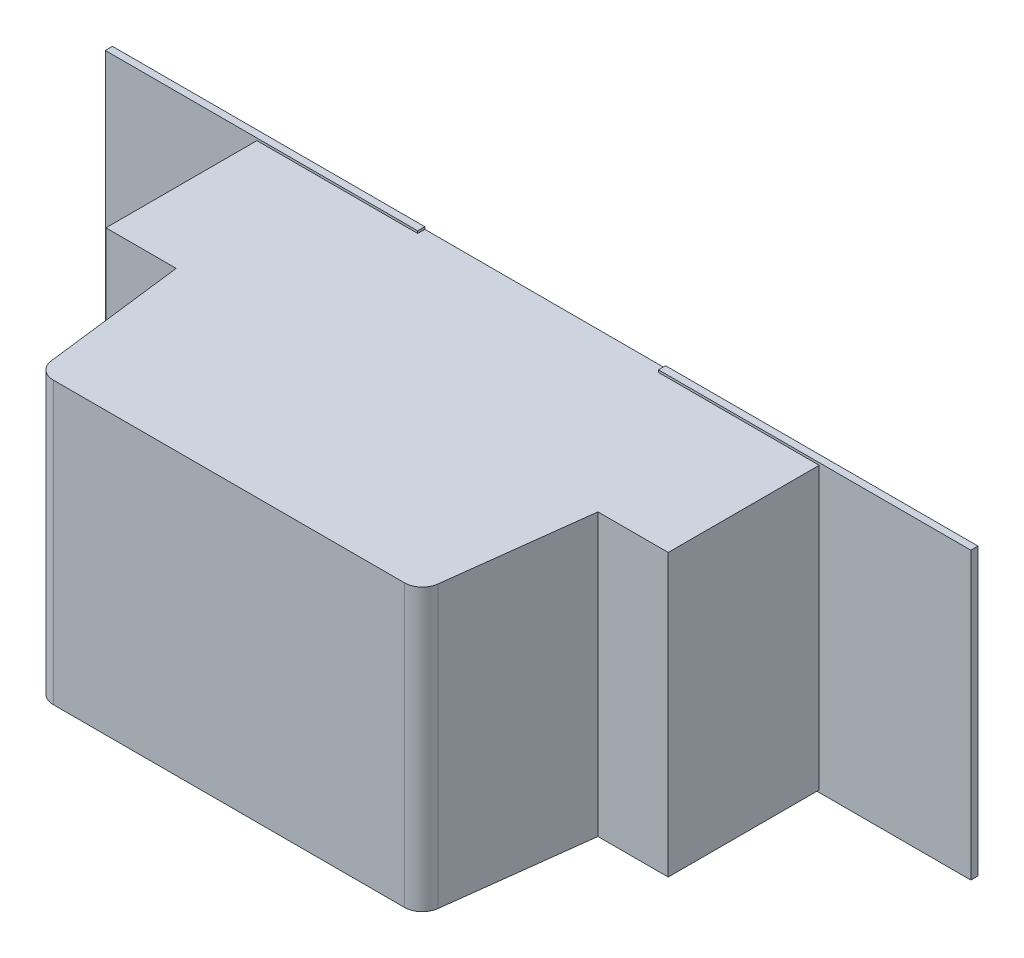
ISO-10303-21;
HEADER;
FILE_DESCRIPTION(('STEP AP214'),'2;1');
FILE_NAME('part.step','',(''),(''),'','','');
FILE_SCHEMA(('AUTOMOTIVE_DESIGN { 1 0 10303 214 1 1 1 1 }'));
ENDSEC;
DATA;
#1=APPLICATION_CONTEXT('core data for automotive mechanical design processes');
#2=APPLICATION_PROTOCOL_DEFINITION('international standard','automotive_design',2000,#1);
#3=PRODUCT_CONTEXT('',#1,'mechanical');
#4=PRODUCT('Part','Part','',(#3));
#5=PRODUCT_RELATED_PRODUCT_CATEGORY('part','',(#4));
#6=PRODUCT_DEFINITION_FORMATION('','',#4);
#7=PRODUCT_DEFINITION_CONTEXT('part definition',#1,'design');
#8=PRODUCT_DEFINITION('design','',#6,#7);
#9=PRODUCT_DEFINITION_SHAPE('','',#8);
#10=(LENGTH_UNIT() NAMED_UNIT(*) SI_UNIT(.MILLI.,.METRE.));
#11=(NAMED_UNIT(*) PLANE_ANGLE_UNIT() SI_UNIT($,.RADIAN.));
#12=(NAMED_UNIT(*) SI_UNIT($,.STERADIAN.) SOLID_ANGLE_UNIT());
#13=UNCERTAINTY_MEASURE_WITH_UNIT(LENGTH_MEASURE(1.E-05),#10,'distance_accuracy_value','');
#14=(GEOMETRIC_REPRESENTATION_CONTEXT(3) GLOBAL_UNCERTAINTY_ASSIGNED_CONTEXT((#13)) GLOBAL_UNIT_ASSIGNED_CONTEXT((#10,
#11,#12)) REPRESENTATION_CONTEXT('',''));
#15=CARTESIAN_POINT('',(0.,0.,0.));
#16=DIRECTION('',(0.,0.,1.));
#17=DIRECTION('',(1.,0.,0.));
#18=AXIS2_PLACEMENT_3D('',#15,#16,#17);
#19=CARTESIAN_POINT('',(1.2314936,0.4065016,0.0762));
#20=DIRECTION('',(0.,1.,0.));
#21=DIRECTION('',(1.,0.,0.));
#22=AXIS2_PLACEMENT_3D('',#19,#20,#21);
#23=PLANE('',#22);
#24=DIRECTION('',(0.,0.,1.));
#25=VECTOR('',#24,1.);
#26=CARTESIAN_POINT('',(0.3424936,0.4065016,0.0762));
#27=LINE('',#26,#25);
#28=CARTESIAN_POINT('',(0.3424936,0.4065016,0.0762));
#29=VERTEX_POINT('',#28);
#30=CARTESIAN_POINT('',(0.3424936,0.4065016,0.09652));
#31=VERTEX_POINT('',#30);
#32=EDGE_CURVE('E374',#29,#31,#27,.T.);
#33=ORIENTED_EDGE('',*,*,#32,.T.);
#34=DIRECTION('',(-1.,0.,0.));
#35=VECTOR('',#34,1.);
#36=CARTESIAN_POINT('',(1.2314936,0.4065016,0.09652));
#37=LINE('',#36,#35);
#38=CARTESIAN_POINT('',(1.2314936,0.4065016,0.09652));
#39=VERTEX_POINT('',#38);
#40=EDGE_CURVE('E401',#39,#31,#37,.T.);
#41=ORIENTED_EDGE('',*,*,#40,.F.);
#42=DIRECTION('',(0.,0.,1.));
#43=VECTOR('',#42,1.);
#44=CARTESIAN_POINT('',(1.2314936,0.4065016,0.0762));
#45=LINE('',#44,#43);
#46=CARTESIAN_POINT('',(1.2314936,0.4065016,0.0762));
#47=VERTEX_POINT('',#46);
#48=EDGE_CURVE('E11',#47,#39,#45,.T.);
#49=ORIENTED_EDGE('',*,*,#48,.F.);
#50=DIRECTION('',(-1.,0.,0.));
#51=VECTOR('',#50,1.);
#52=CARTESIAN_POINT('',(1.2314936,0.4065016,0.0762));
#53=LINE('',#52,#51);
#54=EDGE_CURVE('E323',#47,#29,#53,.T.);
#55=ORIENTED_EDGE('',*,*,#54,.T.);
#56=EDGE_LOOP('',(#33,#41,#49,#55));
#57=FACE_BOUND('',#56,.T.);
#58=ADVANCED_FACE('F17',(#57),#23,.T.);
#59=CARTESIAN_POINT('',(1.2314936,-0.4065016,0.0762));
#60=DIRECTION('',(1.,0.,0.));
#61=DIRECTION('',(0.,1.,0.));
#62=AXIS2_PLACEMENT_3D('',#59,#60,#61);
#63=PLANE('',#62);
#64=ORIENTED_EDGE('',*,*,#48,.T.);
#65=DIRECTION('',(0.,1.,0.));
#66=VECTOR('',#65,1.);
#67=CARTESIAN_POINT('',(1.2314936,-0.4065016,0.09652));
#68=LINE('',#67,#66);
#69=CARTESIAN_POINT('',(1.2314936,-0.4065016,0.09652));
#70=VERTEX_POINT('',#69);
#71=EDGE_CURVE('E406',#70,#39,#68,.T.);
#72=ORIENTED_EDGE('',*,*,#71,.F.);
#73=DIRECTION('',(0.,0.,1.));
#74=VECTOR('',#73,1.);
#75=CARTESIAN_POINT('',(1.2314936,-0.4065016,0.0762));
#76=LINE('',#75,#74);
#77=CARTESIAN_POINT('',(1.2314936,-0.4065016,0.0762));
#78=VERTEX_POINT('',#77);
#79=EDGE_CURVE('E28',#78,#70,#76,.T.);
#80=ORIENTED_EDGE('',*,*,#79,.F.);
#81=DIRECTION('',(0.,1.,0.));
#82=VECTOR('',#81,1.);
#83=CARTESIAN_POINT('',(1.2314936,-0.4065016,0.0762));
#84=LINE('',#83,#82);
#85=EDGE_CURVE('E328',#78,#47,#84,.T.);
#86=ORIENTED_EDGE('',*,*,#85,.T.);
#87=EDGE_LOOP('',(#64,#72,#80,#86));
#88=FACE_BOUND('',#87,.T.);
#89=ADVANCED_FACE('F511',(#88),#63,.T.);
#90=CARTESIAN_POINT('',(0.3424936,-0.4065016,0.0762));
#91=DIRECTION('',(0.,-1.,0.));
#92=DIRECTION('',(0.,0.,-1.));
#93=AXIS2_PLACEMENT_3D('',#90,#91,#92);
#94=PLANE('',#93);
#95=ORIENTED_EDGE('',*,*,#79,.T.);
#96=DIRECTION('',(1.,0.,0.));
#97=VECTOR('',#96,1.);
#98=CARTESIAN_POINT('',(0.3424936,-0.4065016,0.09652));
#99=LINE('',#98,#97);
#100=CARTESIAN_POINT('',(0.3424936,-0.4065016,0.09652));
#101=VERTEX_POINT('',#100);
#102=EDGE_CURVE('E372',#101,#70,#99,.T.);
#103=ORIENTED_EDGE('',*,*,#102,.F.);
#104=DIRECTION('',(0.,0.,1.));
#105=VECTOR('',#104,1.);
#106=CARTESIAN_POINT('',(0.3424936,-0.4065016,0.0762));
#107=LINE('',#106,#105);
#108=CARTESIAN_POINT('',(0.3424936,-0.4065016,0.0762));
#109=VERTEX_POINT('',#108);
#110=EDGE_CURVE('E191',#109,#101,#107,.T.);
#111=ORIENTED_EDGE('',*,*,#110,.F.);
#112=DIRECTION('',(1.,0.,0.));
#113=VECTOR('',#112,1.);
#114=CARTESIAN_POINT('',(0.3424936,-0.4065016,0.0762));
#115=LINE('',#114,#113);
#116=EDGE_CURVE('E331',#109,#78,#115,.T.);
#117=ORIENTED_EDGE('',*,*,#116,.T.);
#118=EDGE_LOOP('',(#95,#103,#111,#117));
#119=FACE_BOUND('',#118,.T.);
#120=ADVANCED_FACE('F466',(#119),#94,.T.);
#121=CARTESIAN_POINT('',(0.3424936,0.4065016,0.0762));
#122=DIRECTION('',(-1.,0.,0.));
#123=DIRECTION('',(0.,0.,1.));
#124=AXIS2_PLACEMENT_3D('',#121,#122,#123);
#125=PLANE('',#124);
#126=DIRECTION('',(0.,-1.,0.));
#127=VECTOR('',#126,1.);
#128=CARTESIAN_POINT('',(0.3424936,0.4065016,0.09652));
#129=LINE('',#128,#127);
#130=CARTESIAN_POINT('',(0.3424936,0.4,0.09652));
#131=VERTEX_POINT('',#130);
#132=EDGE_CURVE('E405',#31,#131,#129,.T.);
#133=ORIENTED_EDGE('',*,*,#132,.F.);
#134=ORIENTED_EDGE('',*,*,#32,.F.);
#135=DIRECTION('',(0.,-1.,0.));
#136=VECTOR('',#135,1.);
#137=CARTESIAN_POINT('',(0.3424936,0.4065016,0.0762));
#138=LINE('',#137,#136);
#139=CARTESIAN_POINT('',(0.3424936,0.4,0.0762));
#140=VERTEX_POINT('',#139);
#141=EDGE_CURVE('E320',#29,#140,#138,.T.);
#142=ORIENTED_EDGE('',*,*,#141,.T.);
#143=DIRECTION('',(0.,0.,1.));
#144=VECTOR('',#143,1.);
#145=CARTESIAN_POINT('',(0.3424936,0.4,0.0762));
#146=LINE('',#145,#144);
#147=EDGE_CURVE('E269',#140,#131,#146,.T.);
#148=ORIENTED_EDGE('',*,*,#147,.T.);
#149=EDGE_LOOP('',(#133,#134,#142,#148));
#150=FACE_BOUND('',#149,.T.);
#151=ADVANCED_FACE('F525',(#150),#125,.T.);
#152=CARTESIAN_POINT('',(0.3424936,0.4065016,0.0762));
#153=DIRECTION('',(-1.,0.,0.));
#154=DIRECTION('',(0.,0.,1.));
#155=AXIS2_PLACEMENT_3D('',#152,#153,#154);
#156=PLANE('',#155);
#157=DIRECTION('',(0.,-1.,0.));
#158=VECTOR('',#157,1.);
#159=CARTESIAN_POINT('',(0.3424936,-0.4,0.0762));
#160=LINE('',#159,#158);
#161=CARTESIAN_POINT('',(0.3424936,-0.4,0.0762));
#162=VERTEX_POINT('',#161);
#163=EDGE_CURVE('E282',#162,#109,#160,.T.);
#164=ORIENTED_EDGE('',*,*,#163,.T.);
#165=ORIENTED_EDGE('',*,*,#110,.T.);
#166=DIRECTION('',(0.,-1.,0.));
#167=VECTOR('',#166,1.);
#168=CARTESIAN_POINT('',(0.3424936,-0.4,0.09652));
#169=LINE('',#168,#167);
#170=CARTESIAN_POINT('',(0.3424936,-0.4,0.09652));
#171=VERTEX_POINT('',#170);
#172=EDGE_CURVE('E368',#171,#101,#169,.T.);
#173=ORIENTED_EDGE('',*,*,#172,.F.);
#174=DIRECTION('',(0.,0.,1.));
#175=VECTOR('',#174,1.);
#176=CARTESIAN_POINT('',(0.3424936,-0.4,0.0762));
#177=LINE('',#176,#175);
#178=EDGE_CURVE('E312',#162,#171,#177,.T.);
#179=ORIENTED_EDGE('',*,*,#178,.F.);
#180=EDGE_LOOP('',(#164,#165,#173,#179));
#181=FACE_BOUND('',#180,.T.);
#182=ADVANCED_FACE('F19',(#181),#156,.T.);
#183=CARTESIAN_POINT('',(-1.2314936,-0.4065016,0.0762));
#184=DIRECTION('',(0.,-1.,0.));
#185=DIRECTION('',(0.,0.,-1.));
#186=AXIS2_PLACEMENT_3D('',#183,#184,#185);
#187=PLANE('',#186);
#188=DIRECTION('',(0.,0.,1.));
#189=VECTOR('',#188,1.);
#190=CARTESIAN_POINT('',(-0.3424936,-0.4065016,0.0762));
#191=LINE('',#190,#189);
#192=CARTESIAN_POINT('',(-0.3424936,-0.4065016,0.0762));
#193=VERTEX_POINT('',#192);
#194=CARTESIAN_POINT('',(-0.3424936,-0.4065016,0.09652));
#195=VERTEX_POINT('',#194);
#196=EDGE_CURVE('E376',#193,#195,#191,.T.);
#197=ORIENTED_EDGE('',*,*,#196,.T.);
#198=DIRECTION('',(1.,0.,0.));
#199=VECTOR('',#198,1.);
#200=CARTESIAN_POINT('',(-1.2314936,-0.4065016,0.09652));
#201=LINE('',#200,#199);
#202=CARTESIAN_POINT('',(-1.2314936,-0.4065016,0.09652));
#203=VERTEX_POINT('',#202);
#204=EDGE_CURVE('E298',#203,#195,#201,.T.);
#205=ORIENTED_EDGE('',*,*,#204,.F.);
#206=DIRECTION('',(0.,0.,1.));
#207=VECTOR('',#206,1.);
#208=CARTESIAN_POINT('',(-1.2314936,-0.4065016,0.0762));
#209=LINE('',#208,#207);
#210=CARTESIAN_POINT('',(-1.2314936,-0.4065016,0.0762));
#211=VERTEX_POINT('',#210);
#212=EDGE_CURVE('E333',#211,#203,#209,.T.);
#213=ORIENTED_EDGE('',*,*,#212,.F.);
#214=DIRECTION('',(1.,0.,0.));
#215=VECTOR('',#214,1.);
#216=CARTESIAN_POINT('',(-1.2314936,-0.4065016,0.0762));
#217=LINE('',#216,#215);
#218=EDGE_CURVE('E278',#211,#193,#217,.T.);
#219=ORIENTED_EDGE('',*,*,#218,.T.);
#220=EDGE_LOOP('',(#197,#205,#213,#219));
#221=FACE_BOUND('',#220,.T.);
#222=ADVANCED_FACE('F519',(#221),#187,.T.);
#223=CARTESIAN_POINT('',(-1.2314936,0.4065016,0.0762));
#224=DIRECTION('',(-1.,0.,0.));
#225=DIRECTION('',(0.,0.,1.));
#226=AXIS2_PLACEMENT_3D('',#223,#224,#225);
#227=PLANE('',#226);
#228=ORIENTED_EDGE('',*,*,#212,.T.);
#229=DIRECTION('',(0.,-1.,0.));
#230=VECTOR('',#229,1.);
#231=CARTESIAN_POINT('',(-1.2314936,0.4065016,0.09652));
#232=LINE('',#231,#230);
#233=CARTESIAN_POINT('',(-1.2314936,0.4065016,0.09652));
#234=VERTEX_POINT('',#233);
#235=EDGE_CURVE('E303',#234,#203,#232,.T.);
#236=ORIENTED_EDGE('',*,*,#235,.F.);
#237=DIRECTION('',(0.,0.,1.));
#238=VECTOR('',#237,1.);
#239=CARTESIAN_POINT('',(-1.2314936,0.4065016,0.0762));
#240=LINE('',#239,#238);
#241=CARTESIAN_POINT('',(-1.2314936,0.4065016,0.0762));
#242=VERTEX_POINT('',#241);
#243=EDGE_CURVE('E41',#242,#234,#240,.T.);
#244=ORIENTED_EDGE('',*,*,#243,.F.);
#245=DIRECTION('',(0.,-1.,0.));
#246=VECTOR('',#245,1.);
#247=CARTESIAN_POINT('',(-1.2314936,0.4065016,0.0762));
#248=LINE('',#247,#246);
#249=EDGE_CURVE('E281',#242,#211,#248,.T.);
#250=ORIENTED_EDGE('',*,*,#249,.T.);
#251=EDGE_LOOP('',(#228,#236,#244,#250));
#252=FACE_BOUND('',#251,.T.);
#253=ADVANCED_FACE('F521',(#252),#227,.T.);
#254=CARTESIAN_POINT('',(-0.3424936,0.4065016,0.0762));
#255=DIRECTION('',(0.,1.,0.));
#256=DIRECTION('',(1.,0.,0.));
#257=AXIS2_PLACEMENT_3D('',#254,#255,#256);
#258=PLANE('',#257);
#259=ORIENTED_EDGE('',*,*,#243,.T.);
#260=DIRECTION('',(-1.,0.,0.));
#261=VECTOR('',#260,1.);
#262=CARTESIAN_POINT('',(-0.3424936,0.4065016,0.09652));
#263=LINE('',#262,#261);
#264=CARTESIAN_POINT('',(-0.3424936,0.4065016,0.09652));
#265=VERTEX_POINT('',#264);
#266=EDGE_CURVE('E258',#265,#234,#263,.T.);
#267=ORIENTED_EDGE('',*,*,#266,.F.);
#268=DIRECTION('',(0.,0.,1.));
#269=VECTOR('',#268,1.);
#270=CARTESIAN_POINT('',(-0.3424936,0.4065016,0.0762));
#271=LINE('',#270,#269);
#272=CARTESIAN_POINT('',(-0.3424936,0.4065016,0.0762));
#273=VERTEX_POINT('',#272);
#274=EDGE_CURVE('E253',#273,#265,#271,.T.);
#275=ORIENTED_EDGE('',*,*,#274,.F.);
#276=DIRECTION('',(-1.,0.,0.));
#277=VECTOR('',#276,1.);
#278=CARTESIAN_POINT('',(-0.3424936,0.4065016,0.0762));
#279=LINE('',#278,#277);
#280=EDGE_CURVE('E334',#273,#242,#279,.T.);
#281=ORIENTED_EDGE('',*,*,#280,.T.);
#282=EDGE_LOOP('',(#259,#267,#275,#281));
#283=FACE_BOUND('',#282,.T.);
#284=ADVANCED_FACE('F558',(#283),#258,.T.);
#285=CARTESIAN_POINT('',(0.8,-0.4,0.0762));
#286=DIRECTION('',(0.,0.,-1.));
#287=DIRECTION('',(0.,-1.,0.));
#288=AXIS2_PLACEMENT_3D('',#285,#286,#287);
#289=PLANE('',#288);
#290=ORIENTED_EDGE('',*,*,#141,.F.);
#291=ORIENTED_EDGE('',*,*,#54,.F.);
#292=ORIENTED_EDGE('',*,*,#85,.F.);
#293=ORIENTED_EDGE('',*,*,#116,.F.);
#294=ORIENTED_EDGE('',*,*,#163,.F.);
#295=DIRECTION('',(-1.,0.,0.));
#296=VECTOR('',#295,1.);
#297=CARTESIAN_POINT('',(0.3424936,-0.4,0.0762));
#298=LINE('',#297,#296);
#299=CARTESIAN_POINT('',(-0.3424936,-0.4,0.0762));
#300=VERTEX_POINT('',#299);
#301=EDGE_CURVE('E317',#162,#300,#298,.T.);
#302=ORIENTED_EDGE('',*,*,#301,.T.);
#303=DIRECTION('',(0.,1.,0.));
#304=VECTOR('',#303,1.);
#305=CARTESIAN_POINT('',(-0.3424936,-0.4065016,0.0762));
#306=LINE('',#305,#304);
#307=EDGE_CURVE('E383',#193,#300,#306,.T.);
#308=ORIENTED_EDGE('',*,*,#307,.F.);
#309=ORIENTED_EDGE('',*,*,#218,.F.);
#310=ORIENTED_EDGE('',*,*,#249,.F.);
#311=ORIENTED_EDGE('',*,*,#280,.F.);
#312=DIRECTION('',(0.,1.,0.));
#313=VECTOR('',#312,1.);
#314=CARTESIAN_POINT('',(-0.3424936,0.4,0.0762));
#315=LINE('',#314,#313);
#316=CARTESIAN_POINT('',(-0.3424936,0.4,0.0762));
#317=VERTEX_POINT('',#316);
#318=EDGE_CURVE('E394',#317,#273,#315,.T.);
#319=ORIENTED_EDGE('',*,*,#318,.F.);
#320=DIRECTION('',(-1.,0.,0.));
#321=VECTOR('',#320,1.);
#322=CARTESIAN_POINT('',(0.3424936,0.4,0.0762));
#323=LINE('',#322,#321);
#324=EDGE_CURVE('E272',#140,#317,#323,.T.);
#325=ORIENTED_EDGE('',*,*,#324,.F.);
#326=EDGE_LOOP('',(#290,#291,#292,#293,#294,#302,#308,#309,#310,#311,#319,#325));
#327=FACE_BOUND('',#326,.T.);
#328=ADVANCED_FACE('F554',(#327),#289,.T.);
#329=CARTESIAN_POINT('',(-0.3424936,-0.4065016,0.0762));
#330=DIRECTION('',(1.,0.,0.));
#331=DIRECTION('',(0.,1.,0.));
#332=AXIS2_PLACEMENT_3D('',#329,#330,#331);
#333=PLANE('',#332);
#334=ORIENTED_EDGE('',*,*,#318,.T.);
#335=ORIENTED_EDGE('',*,*,#274,.T.);
#336=DIRECTION('',(0.,1.,0.));
#337=VECTOR('',#336,1.);
#338=CARTESIAN_POINT('',(-0.3424936,0.4,0.09652));
#339=LINE('',#338,#337);
#340=CARTESIAN_POINT('',(-0.3424936,0.4,0.09652));
#341=VERTEX_POINT('',#340);
#342=EDGE_CURVE('E255',#341,#265,#339,.T.);
#343=ORIENTED_EDGE('',*,*,#342,.F.);
#344=DIRECTION('',(0.,0.,1.));
#345=VECTOR('',#344,1.);
#346=CARTESIAN_POINT('',(-0.3424936,0.4,0.0762));
#347=LINE('',#346,#345);
#348=EDGE_CURVE('E367',#317,#341,#347,.T.);
#349=ORIENTED_EDGE('',*,*,#348,.F.);
#350=EDGE_LOOP('',(#334,#335,#343,#349));
#351=FACE_BOUND('',#350,.T.);
#352=ADVANCED_FACE('F505',(#351),#333,.T.);
#353=CARTESIAN_POINT('',(-0.3424936,-0.4065016,0.0762));
#354=DIRECTION('',(1.,0.,0.));
#355=DIRECTION('',(0.,1.,0.));
#356=AXIS2_PLACEMENT_3D('',#353,#354,#355);
#357=PLANE('',#356);
#358=DIRECTION('',(0.,1.,0.));
#359=VECTOR('',#358,1.);
#360=CARTESIAN_POINT('',(-0.3424936,-0.4065016,0.09652));
#361=LINE('',#360,#359);
#362=CARTESIAN_POINT('',(-0.3424936,-0.4,0.09652));
#363=VERTEX_POINT('',#362);
#364=EDGE_CURVE('E302',#195,#363,#361,.T.);
#365=ORIENTED_EDGE('',*,*,#364,.F.);
#366=ORIENTED_EDGE('',*,*,#196,.F.);
#367=ORIENTED_EDGE('',*,*,#307,.T.);
#368=DIRECTION('',(0.,0.,1.));
#369=VECTOR('',#368,1.);
#370=CARTESIAN_POINT('',(-0.3424936,-0.4,0.0762));
#371=LINE('',#370,#369);
#372=EDGE_CURVE('E264',#300,#363,#371,.T.);
#373=ORIENTED_EDGE('',*,*,#372,.T.);
#374=EDGE_LOOP('',(#365,#366,#367,#373));
#375=FACE_BOUND('',#374,.T.);
#376=ADVANCED_FACE('F495',(#375),#357,.T.);
#377=CARTESIAN_POINT('',(0.,0.4,0.0762));
#378=DIRECTION('',(0.,1.,0.));
#379=DIRECTION('',(1.,0.,0.));
#380=AXIS2_PLACEMENT_3D('',#377,#378,#379);
#381=PLANE('',#380);
#382=ORIENTED_EDGE('',*,*,#147,.F.);
#383=ORIENTED_EDGE('',*,*,#324,.T.);
#384=ORIENTED_EDGE('',*,*,#348,.T.);
#385=DIRECTION('',(-1.,0.,0.));
#386=VECTOR('',#385,1.);
#387=CARTESIAN_POINT('',(-0.3424936,0.4,0.09652));
#388=LINE('',#387,#386);
#389=CARTESIAN_POINT('',(-0.8,0.4,0.09652));
#390=VERTEX_POINT('',#389);
#391=EDGE_CURVE('E259',#341,#390,#388,.T.);
#392=ORIENTED_EDGE('',*,*,#391,.T.);
#393=DIRECTION('',(0.,0.,1.));
#394=VECTOR('',#393,1.);
#395=CARTESIAN_POINT('',(-0.8,0.4,0.09652));
#396=LINE('',#395,#394);
#397=CARTESIAN_POINT('',(-0.8,0.4,0.5262));
#398=VERTEX_POINT('',#397);
#399=EDGE_CURVE('E273',#390,#398,#396,.T.);
#400=ORIENTED_EDGE('',*,*,#399,.T.);
#401=DIRECTION('',(1.,0.,0.));
#402=VECTOR('',#401,1.);
#403=CARTESIAN_POINT('',(-0.8,0.4,0.5262));
#404=LINE('',#403,#402);
#405=CARTESIAN_POINT('',(-0.6,0.4,0.5262));
#406=VERTEX_POINT('',#405);
#407=EDGE_CURVE('E304',#398,#406,#404,.T.);
#408=ORIENTED_EDGE('',*,*,#407,.T.);
#409=DIRECTION('',(0.122402128164196,0.,0.992480588737571));
#410=VECTOR('',#409,1.);
#411=CARTESIAN_POINT('',(-0.6,0.4,0.5262));
#412=LINE('',#411,#410);
#413=CARTESIAN_POINT('',(-0.55,0.4,0.9316180281107));
#414=VERTEX_POINT('',#413);
#415=EDGE_CURVE('E287',#406,#414,#412,.T.);
#416=ORIENTED_EDGE('',*,*,#415,.T.);
#417=CARTESIAN_POINT('',(-0.4995819860921,0.4,0.9254));
#418=DIRECTION('',(0.,1.,0.));
#419=DIRECTION('',(-0.992480588737571,0.,0.122402128164196));
#420=AXIS2_PLACEMENT_3D('',#417,#418,#419);
#421=CIRCLE('',#420,0.0508);
#422=CARTESIAN_POINT('',(-0.4995819860921,0.4,0.9762));
#423=VERTEX_POINT('',#422);
#424=EDGE_CURVE('E288',#414,#423,#421,.T.);
#425=ORIENTED_EDGE('',*,*,#424,.T.);
#426=DIRECTION('',(1.,0.,0.));
#427=VECTOR('',#426,1.);
#428=CARTESIAN_POINT('',(-0.4995819860921,0.4,0.9762));
#429=LINE('',#428,#427);
#430=CARTESIAN_POINT('',(0.4995819860921,0.4,0.9762));
#431=VERTEX_POINT('',#430);
#432=EDGE_CURVE('E324',#423,#431,#429,.T.);
#433=ORIENTED_EDGE('',*,*,#432,.T.);
#434=CARTESIAN_POINT('',(0.4995819860921,0.4,0.9254));
#435=DIRECTION('',(0.,1.,0.));
#436=DIRECTION('',(0.,0.,1.));
#437=AXIS2_PLACEMENT_3D('',#434,#435,#436);
#438=CIRCLE('',#437,0.0508);
#439=CARTESIAN_POINT('',(0.55,0.4,0.9316180281107));
#440=VERTEX_POINT('',#439);
#441=EDGE_CURVE('E224',#431,#440,#438,.T.);
#442=ORIENTED_EDGE('',*,*,#441,.T.);
#443=DIRECTION('',(0.122402128164196,0.,-0.992480588737571));
#444=VECTOR('',#443,1.);
#445=CARTESIAN_POINT('',(0.55,0.4,0.9316180281107));
#446=LINE('',#445,#444);
#447=CARTESIAN_POINT('',(0.6,0.4,0.5262));
#448=VERTEX_POINT('',#447);
#449=EDGE_CURVE('E220',#440,#448,#446,.T.);
#450=ORIENTED_EDGE('',*,*,#449,.T.);
#451=DIRECTION('',(1.,0.,0.));
#452=VECTOR('',#451,1.);
#453=CARTESIAN_POINT('',(0.6,0.4,0.5262));
#454=LINE('',#453,#452);
#455=CARTESIAN_POINT('',(0.8,0.4,0.5262));
#456=VERTEX_POINT('',#455);
#457=EDGE_CURVE('E293',#448,#456,#454,.T.);
#458=ORIENTED_EDGE('',*,*,#457,.T.);
#459=DIRECTION('',(0.,0.,-1.));
#460=VECTOR('',#459,1.);
#461=CARTESIAN_POINT('',(0.8,0.4,0.5262));
#462=LINE('',#461,#460);
#463=CARTESIAN_POINT('',(0.8,0.4,0.09652));
#464=VERTEX_POINT('',#463);
#465=EDGE_CURVE('E294',#456,#464,#462,.T.);
#466=ORIENTED_EDGE('',*,*,#465,.T.);
#467=DIRECTION('',(-1.,0.,0.));
#468=VECTOR('',#467,1.);
#469=CARTESIAN_POINT('',(0.8,0.4,0.09652));
#470=LINE('',#469,#468);
#471=EDGE_CURVE('E421',#464,#131,#470,.T.);
#472=ORIENTED_EDGE('',*,*,#471,.T.);
#473=EDGE_LOOP('',(#382,#383,#384,#392,#400,#408,#416,#425,#433,#442,#450,#458,#466,#472));
#474=FACE_BOUND('',#473,.T.);
#475=ADVANCED_FACE('F493',(#474),#381,.T.);
#476=CARTESIAN_POINT('',(-0.8,-0.4,0.0762));
#477=DIRECTION('',(-1.,0.,0.));
#478=DIRECTION('',(0.,0.,1.));
#479=AXIS2_PLACEMENT_3D('',#476,#477,#478);
#480=PLANE('',#479);
#481=DIRECTION('',(0.,0.,1.));
#482=VECTOR('',#481,1.);
#483=CARTESIAN_POINT('',(-0.8,-0.4,0.09652));
#484=LINE('',#483,#482);
#485=CARTESIAN_POINT('',(-0.8,-0.4,0.09652));
#486=VERTEX_POINT('',#485);
#487=CARTESIAN_POINT('',(-0.8,-0.4,0.5262));
#488=VERTEX_POINT('',#487);
#489=EDGE_CURVE('E265',#486,#488,#484,.T.);
#490=ORIENTED_EDGE('',*,*,#489,.T.);
#491=DIRECTION('',(0.,1.,0.));
#492=VECTOR('',#491,1.);
#493=CARTESIAN_POINT('',(-0.8,-0.4,0.5262));
#494=LINE('',#493,#492);
#495=EDGE_CURVE('E306',#488,#398,#494,.T.);
#496=ORIENTED_EDGE('',*,*,#495,.T.);
#497=ORIENTED_EDGE('',*,*,#399,.F.);
#498=DIRECTION('',(0.,1.,0.));
#499=VECTOR('',#498,1.);
#500=CARTESIAN_POINT('',(-0.8,-0.4,0.09652));
#501=LINE('',#500,#499);
#502=EDGE_CURVE('E277',#486,#390,#501,.T.);
#503=ORIENTED_EDGE('',*,*,#502,.F.);
#504=EDGE_LOOP('',(#490,#496,#497,#503));
#505=FACE_BOUND('',#504,.T.);
#506=ADVANCED_FACE('F489',(#505),#480,.T.);
#507=CARTESIAN_POINT('',(-0.8,-0.4,0.5262));
#508=DIRECTION('',(0.,0.,1.));
#509=DIRECTION('',(1.,0.,0.));
#510=AXIS2_PLACEMENT_3D('',#507,#508,#509);
#511=PLANE('',#510);
#512=DIRECTION('',(0.,1.,0.));
#513=VECTOR('',#512,1.);
#514=CARTESIAN_POINT('',(-0.6,-0.4,0.5262));
#515=LINE('',#514,#513);
#516=CARTESIAN_POINT('',(-0.6,-0.4,0.5262));
#517=VERTEX_POINT('',#516);
#518=EDGE_CURVE('E307',#517,#406,#515,.T.);
#519=ORIENTED_EDGE('',*,*,#518,.T.);
#520=ORIENTED_EDGE('',*,*,#407,.F.);
#521=ORIENTED_EDGE('',*,*,#495,.F.);
#522=DIRECTION('',(1.,0.,0.));
#523=VECTOR('',#522,1.);
#524=CARTESIAN_POINT('',(-0.8,-0.4,0.5262));
#525=LINE('',#524,#523);
#526=EDGE_CURVE('E407',#488,#517,#525,.T.);
#527=ORIENTED_EDGE('',*,*,#526,.T.);
#528=EDGE_LOOP('',(#519,#520,#521,#527));
#529=FACE_BOUND('',#528,.T.);
#530=ADVANCED_FACE('F503',(#529),#511,.T.);
#531=CARTESIAN_POINT('',(-0.6,-0.4,0.5262));
#532=DIRECTION('',(-0.992480588737571,0.,0.122402128164196));
#533=DIRECTION('',(0.,1.,0.));
#534=AXIS2_PLACEMENT_3D('',#531,#532,#533);
#535=PLANE('',#534);
#536=DIRECTION('',(0.,1.,0.));
#537=VECTOR('',#536,1.);
#538=CARTESIAN_POINT('',(-0.55,-0.4,0.9316180281107));
#539=LINE('',#538,#537);
#540=CARTESIAN_POINT('',(-0.55,-0.4,0.9316180281107));
#541=VERTEX_POINT('',#540);
#542=EDGE_CURVE('E283',#541,#414,#539,.T.);
#543=ORIENTED_EDGE('',*,*,#542,.T.);
#544=ORIENTED_EDGE('',*,*,#415,.F.);
#545=ORIENTED_EDGE('',*,*,#518,.F.);
#546=DIRECTION('',(0.122402128164196,0.,0.992480588737571));
#547=VECTOR('',#546,1.);
#548=CARTESIAN_POINT('',(-0.6,-0.4,0.5262));
#549=LINE('',#548,#547);
#550=EDGE_CURVE('E21',#517,#541,#549,.T.);
#551=ORIENTED_EDGE('',*,*,#550,.T.);
#552=EDGE_LOOP('',(#543,#544,#545,#551));
#553=FACE_BOUND('',#552,.T.);
#554=ADVANCED_FACE('F530',(#553),#535,.T.);
#555=CARTESIAN_POINT('',(-0.4995819860921,-0.4,0.9254));
#556=DIRECTION('',(0.,1.,0.));
#557=DIRECTION('',(-1.,0.,0.));
#558=AXIS2_PLACEMENT_3D('',#555,#556,#557);
#559=CYLINDRICAL_SURFACE('',#558,0.0508);
#560=DIRECTION('',(0.,1.,0.));
#561=VECTOR('',#560,1.);
#562=CARTESIAN_POINT('',(-0.4995819860921,-0.4,0.9762));
#563=LINE('',#562,#561);
#564=CARTESIAN_POINT('',(-0.4995819860921,-0.4,0.9762));
#565=VERTEX_POINT('',#564);
#566=EDGE_CURVE('E327',#565,#423,#563,.T.);
#567=ORIENTED_EDGE('',*,*,#566,.T.);
#568=ORIENTED_EDGE('',*,*,#424,.F.);
#569=ORIENTED_EDGE('',*,*,#542,.F.);
#570=CARTESIAN_POINT('',(-0.4995819860921,-0.4,0.9254));
#571=DIRECTION('',(0.,1.,0.));
#572=DIRECTION('',(-0.992480588737571,0.,0.122402128164196));
#573=AXIS2_PLACEMENT_3D('',#570,#571,#572);
#574=CIRCLE('',#573,0.0508);
#575=EDGE_CURVE('E268',#541,#565,#574,.T.);
#576=ORIENTED_EDGE('',*,*,#575,.T.);
#577=EDGE_LOOP('',(#567,#568,#569,#576));
#578=FACE_BOUND('',#577,.T.);
#579=ADVANCED_FACE('F526',(#578),#559,.T.);
#580=CARTESIAN_POINT('',(-0.4995819860921,-0.4,0.9762));
#581=DIRECTION('',(0.,0.,1.));
#582=DIRECTION('',(1.,0.,0.));
#583=AXIS2_PLACEMENT_3D('',#580,#581,#582);
#584=PLANE('',#583);
#585=DIRECTION('',(0.,1.,0.));
#586=VECTOR('',#585,1.);
#587=CARTESIAN_POINT('',(0.4995819860921,-0.4,0.9762));
#588=LINE('',#587,#586);
#589=CARTESIAN_POINT('',(0.4995819860921,-0.4,0.9762));
#590=VERTEX_POINT('',#589);
#591=EDGE_CURVE('E230',#590,#431,#588,.T.);
#592=ORIENTED_EDGE('',*,*,#591,.T.);
#593=ORIENTED_EDGE('',*,*,#432,.F.);
#594=ORIENTED_EDGE('',*,*,#566,.F.);
#595=DIRECTION('',(1.,0.,0.));
#596=VECTOR('',#595,1.);
#597=CARTESIAN_POINT('',(-0.4995819860921,-0.4,0.9762));
#598=LINE('',#597,#596);
#599=EDGE_CURVE('E235',#565,#590,#598,.T.);
#600=ORIENTED_EDGE('',*,*,#599,.T.);
#601=EDGE_LOOP('',(#592,#593,#594,#600));
#602=FACE_BOUND('',#601,.T.);
#603=ADVANCED_FACE('F529',(#602),#584,.T.);
#604=CARTESIAN_POINT('',(0.4995819860921,-0.4,0.9254));
#605=DIRECTION('',(0.,1.,0.));
#606=DIRECTION('',(-1.,0.,0.));
#607=AXIS2_PLACEMENT_3D('',#604,#605,#606);
#608=CYLINDRICAL_SURFACE('',#607,0.0508);
#609=DIRECTION('',(0.,1.,0.));
#610=VECTOR('',#609,1.);
#611=CARTESIAN_POINT('',(0.55,-0.4,0.9316180281107));
#612=LINE('',#611,#610);
#613=CARTESIAN_POINT('',(0.55,-0.4,0.9316180281107));
#614=VERTEX_POINT('',#613);
#615=EDGE_CURVE('E213',#614,#440,#612,.T.);
#616=ORIENTED_EDGE('',*,*,#615,.T.);
#617=ORIENTED_EDGE('',*,*,#441,.F.);
#618=ORIENTED_EDGE('',*,*,#591,.F.);
#619=CARTESIAN_POINT('',(0.4995819860921,-0.4,0.9254));
#620=DIRECTION('',(0.,1.,0.));
#621=DIRECTION('',(0.,0.,1.));
#622=AXIS2_PLACEMENT_3D('',#619,#620,#621);
#623=CIRCLE('',#622,0.0508);
#624=EDGE_CURVE('E227',#590,#614,#623,.T.);
#625=ORIENTED_EDGE('',*,*,#624,.T.);
#626=EDGE_LOOP('',(#616,#617,#618,#625));
#627=FACE_BOUND('',#626,.T.);
#628=ADVANCED_FACE('F228',(#627),#608,.T.);
#629=CARTESIAN_POINT('',(0.55,-0.4,0.9316180281107));
#630=DIRECTION('',(0.992480588737571,0.,0.122402128164196));
#631=DIRECTION('',(0.,-1.,0.));
#632=AXIS2_PLACEMENT_3D('',#629,#630,#631);
#633=PLANE('',#632);
#634=DIRECTION('',(0.,1.,0.));
#635=VECTOR('',#634,1.);
#636=CARTESIAN_POINT('',(0.6,-0.4,0.5262));
#637=LINE('',#636,#635);
#638=CARTESIAN_POINT('',(0.6,-0.4,0.5262));
#639=VERTEX_POINT('',#638);
#640=EDGE_CURVE('E442',#639,#448,#637,.T.);
#641=ORIENTED_EDGE('',*,*,#640,.T.);
#642=ORIENTED_EDGE('',*,*,#449,.F.);
#643=ORIENTED_EDGE('',*,*,#615,.F.);
#644=DIRECTION('',(0.122402128164196,0.,-0.992480588737571));
#645=VECTOR('',#644,1.);
#646=CARTESIAN_POINT('',(0.55,-0.4,0.9316180281107));
#647=LINE('',#646,#645);
#648=EDGE_CURVE('E218',#614,#639,#647,.T.);
#649=ORIENTED_EDGE('',*,*,#648,.T.);
#650=EDGE_LOOP('',(#641,#642,#643,#649));
#651=FACE_BOUND('',#650,.T.);
#652=ADVANCED_FACE('F216',(#651),#633,.T.);
#653=CARTESIAN_POINT('',(0.6,-0.4,0.5262));
#654=DIRECTION('',(0.,0.,1.));
#655=DIRECTION('',(1.,0.,0.));
#656=AXIS2_PLACEMENT_3D('',#653,#654,#655);
#657=PLANE('',#656);
#658=DIRECTION('',(0.,1.,0.));
#659=VECTOR('',#658,1.);
#660=CARTESIAN_POINT('',(0.8,-0.4,0.5262));
#661=LINE('',#660,#659);
#662=CARTESIAN_POINT('',(0.8,-0.4,0.5262));
#663=VERTEX_POINT('',#662);
#664=EDGE_CURVE('E289',#663,#456,#661,.T.);
#665=ORIENTED_EDGE('',*,*,#664,.T.);
#666=ORIENTED_EDGE('',*,*,#457,.F.);
#667=ORIENTED_EDGE('',*,*,#640,.F.);
#668=DIRECTION('',(1.,0.,0.));
#669=VECTOR('',#668,1.);
#670=CARTESIAN_POINT('',(0.6,-0.4,0.5262));
#671=LINE('',#670,#669);
#672=EDGE_CURVE('E240',#639,#663,#671,.T.);
#673=ORIENTED_EDGE('',*,*,#672,.T.);
#674=EDGE_LOOP('',(#665,#666,#667,#673));
#675=FACE_BOUND('',#674,.T.);
#676=ADVANCED_FACE('F976',(#675),#657,.T.);
#677=CARTESIAN_POINT('',(0.8,-0.4,0.5262));
#678=DIRECTION('',(1.,0.,0.));
#679=DIRECTION('',(0.,1.,0.));
#680=AXIS2_PLACEMENT_3D('',#677,#678,#679);
#681=PLANE('',#680);
#682=ORIENTED_EDGE('',*,*,#465,.F.);
#683=ORIENTED_EDGE('',*,*,#664,.F.);
#684=DIRECTION('',(0.,0.,-1.));
#685=VECTOR('',#684,1.);
#686=CARTESIAN_POINT('',(0.8,-0.4,0.5262));
#687=LINE('',#686,#685);
#688=CARTESIAN_POINT('',(0.8,-0.4,0.09652));
#689=VERTEX_POINT('',#688);
#690=EDGE_CURVE('E249',#663,#689,#687,.T.);
#691=ORIENTED_EDGE('',*,*,#690,.T.);
#692=DIRECTION('',(0.,1.,0.));
#693=VECTOR('',#692,1.);
#694=CARTESIAN_POINT('',(0.8,-0.4,0.09652));
#695=LINE('',#694,#693);
#696=EDGE_CURVE('E425',#689,#464,#695,.T.);
#697=ORIENTED_EDGE('',*,*,#696,.T.);
#698=EDGE_LOOP('',(#682,#683,#691,#697));
#699=FACE_BOUND('',#698,.T.);
#700=ADVANCED_FACE('F971',(#699),#681,.T.);
#701=CARTESIAN_POINT('',(0.,0.,0.09652));
#702=DIRECTION('',(0.,0.,1.));
#703=DIRECTION('',(1.,0.,0.));
#704=AXIS2_PLACEMENT_3D('',#701,#702,#703);
#705=PLANE('',#704);
#706=ORIENTED_EDGE('',*,*,#502,.T.);
#707=ORIENTED_EDGE('',*,*,#391,.F.);
#708=ORIENTED_EDGE('',*,*,#342,.T.);
#709=ORIENTED_EDGE('',*,*,#266,.T.);
#710=ORIENTED_EDGE('',*,*,#235,.T.);
#711=ORIENTED_EDGE('',*,*,#204,.T.);
#712=ORIENTED_EDGE('',*,*,#364,.T.);
#713=DIRECTION('',(-1.,0.,0.));
#714=VECTOR('',#713,1.);
#715=CARTESIAN_POINT('',(-0.3424936,-0.4,0.09652));
#716=LINE('',#715,#714);
#717=EDGE_CURVE('E260',#363,#486,#716,.T.);
#718=ORIENTED_EDGE('',*,*,#717,.T.);
#719=EDGE_LOOP('',(#706,#707,#708,#709,#710,#711,#712,#718));
#720=FACE_BOUND('',#719,.T.);
#721=ADVANCED_FACE('F485',(#720),#705,.T.);
#722=CARTESIAN_POINT('',(0.,0.,0.09652));
#723=DIRECTION('',(0.,0.,1.));
#724=DIRECTION('',(1.,0.,0.));
#725=AXIS2_PLACEMENT_3D('',#722,#723,#724);
#726=PLANE('',#725);
#727=ORIENTED_EDGE('',*,*,#172,.T.);
#728=ORIENTED_EDGE('',*,*,#102,.T.);
#729=ORIENTED_EDGE('',*,*,#71,.T.);
#730=ORIENTED_EDGE('',*,*,#40,.T.);
#731=ORIENTED_EDGE('',*,*,#132,.T.);
#732=ORIENTED_EDGE('',*,*,#471,.F.);
#733=ORIENTED_EDGE('',*,*,#696,.F.);
#734=DIRECTION('',(-1.,0.,0.));
#735=VECTOR('',#734,1.);
#736=CARTESIAN_POINT('',(0.8,-0.4,0.09652));
#737=LINE('',#736,#735);
#738=EDGE_CURVE('E316',#689,#171,#737,.T.);
#739=ORIENTED_EDGE('',*,*,#738,.T.);
#740=EDGE_LOOP('',(#727,#728,#729,#730,#731,#732,#733,#739));
#741=FACE_BOUND('',#740,.T.);
#742=ADVANCED_FACE('F458',(#741),#726,.T.);
#743=CARTESIAN_POINT('',(0.,-0.4,0.0762));
#744=DIRECTION('',(0.,1.,0.));
#745=DIRECTION('',(1.,0.,0.));
#746=AXIS2_PLACEMENT_3D('',#743,#744,#745);
#747=PLANE('',#746);
#748=ORIENTED_EDGE('',*,*,#690,.F.);
#749=ORIENTED_EDGE('',*,*,#672,.F.);
#750=ORIENTED_EDGE('',*,*,#648,.F.);
#751=ORIENTED_EDGE('',*,*,#624,.F.);
#752=ORIENTED_EDGE('',*,*,#599,.F.);
#753=ORIENTED_EDGE('',*,*,#575,.F.);
#754=ORIENTED_EDGE('',*,*,#550,.F.);
#755=ORIENTED_EDGE('',*,*,#526,.F.);
#756=ORIENTED_EDGE('',*,*,#489,.F.);
#757=ORIENTED_EDGE('',*,*,#717,.F.);
#758=ORIENTED_EDGE('',*,*,#372,.F.);
#759=ORIENTED_EDGE('',*,*,#301,.F.);
#760=ORIENTED_EDGE('',*,*,#178,.T.);
#761=ORIENTED_EDGE('',*,*,#738,.F.);
#762=EDGE_LOOP('',(#748,#749,#750,#751,#752,#753,#754,#755,#756,#757,#758,#759,#760,#761));
#763=FACE_BOUND('',#762,.T.);
#764=ADVANCED_FACE('F238',(#763),#747,.F.);
#765=CLOSED_SHELL('',(#58,#89,#120,#151,#182,#222,#253,#284,#328,#352,#376,#475,#506,#530,#554,
#579,#603,#628,#652,#676,#700,#721,#742,#764));
#766=MANIFOLD_SOLID_BREP('B1',#765);
#767=ADVANCED_BREP_SHAPE_REPRESENTATION('',(#18,#766),#14);
#768=SHAPE_DEFINITION_REPRESENTATION(#9,#767);
ENDSEC;
END-ISO-10303-21;
